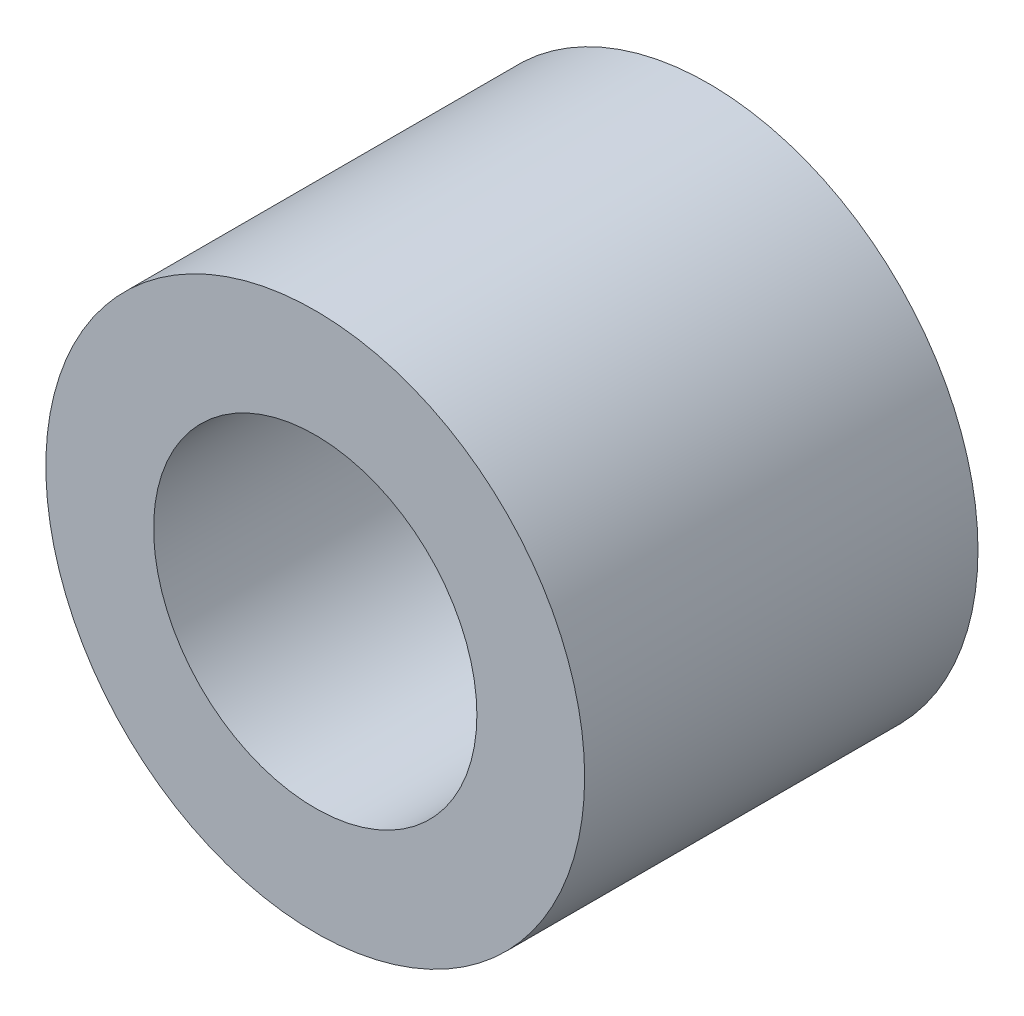
ISO-10303-21;
HEADER;
FILE_DESCRIPTION(('STEP AP214'),'2;1');
FILE_NAME('part.step','',(''),(''),'','','');
FILE_SCHEMA(('AUTOMOTIVE_DESIGN { 1 0 10303 214 1 1 1 1 }'));
ENDSEC;
DATA;
#1=APPLICATION_CONTEXT('core data for automotive mechanical design processes');
#2=APPLICATION_PROTOCOL_DEFINITION('international standard','automotive_design',2000,#1);
#3=PRODUCT_CONTEXT('',#1,'mechanical');
#4=PRODUCT('Part','Part','',(#3));
#5=PRODUCT_RELATED_PRODUCT_CATEGORY('part','',(#4));
#6=PRODUCT_DEFINITION_FORMATION('','',#4);
#7=PRODUCT_DEFINITION_CONTEXT('part definition',#1,'design');
#8=PRODUCT_DEFINITION('design','',#6,#7);
#9=PRODUCT_DEFINITION_SHAPE('','',#8);
#10=(LENGTH_UNIT() NAMED_UNIT(*) SI_UNIT(.MILLI.,.METRE.));
#11=(NAMED_UNIT(*) PLANE_ANGLE_UNIT() SI_UNIT($,.RADIAN.));
#12=(NAMED_UNIT(*) SI_UNIT($,.STERADIAN.) SOLID_ANGLE_UNIT());
#13=UNCERTAINTY_MEASURE_WITH_UNIT(LENGTH_MEASURE(1.E-05),#10,'distance_accuracy_value','');
#14=(GEOMETRIC_REPRESENTATION_CONTEXT(3) GLOBAL_UNCERTAINTY_ASSIGNED_CONTEXT((#13)) GLOBAL_UNIT_ASSIGNED_CONTEXT((#10,
#11,#12)) REPRESENTATION_CONTEXT('',''));
#15=CARTESIAN_POINT('',(0.,0.,0.));
#16=DIRECTION('',(0.,0.,1.));
#17=DIRECTION('',(1.,0.,0.));
#18=AXIS2_PLACEMENT_3D('',#15,#16,#17);
#19=CARTESIAN_POINT('',(0.,0.,3.65));
#20=DIRECTION('',(0.,0.,1.));
#21=DIRECTION('',(1.,0.,0.));
#22=AXIS2_PLACEMENT_3D('',#19,#20,#21);
#23=PLANE('',#22);
#24=CARTESIAN_POINT('',(0.,0.,3.65));
#25=DIRECTION('',(0.,0.,1.));
#26=DIRECTION('',(1.,0.,0.));
#27=AXIS2_PLACEMENT_3D('',#24,#25,#26);
#28=CIRCLE('',#27,2.5);
#29=CARTESIAN_POINT('',(2.5,0.,3.65));
#30=VERTEX_POINT('',#29);
#31=EDGE_CURVE('E10',#30,#30,#28,.T.);
#32=ORIENTED_EDGE('',*,*,#31,.T.);
#33=EDGE_LOOP('',(#32));
#34=FACE_BOUND('',#33,.T.);
#35=CARTESIAN_POINT('',(0.,0.,3.65));
#36=DIRECTION('',(0.,0.,1.));
#37=DIRECTION('',(1.,0.,0.));
#38=AXIS2_PLACEMENT_3D('',#35,#36,#37);
#39=CIRCLE('',#38,1.5);
#40=CARTESIAN_POINT('',(1.5,0.,3.65));
#41=VERTEX_POINT('',#40);
#42=EDGE_CURVE('E46',#41,#41,#39,.T.);
#43=ORIENTED_EDGE('',*,*,#42,.F.);
#44=EDGE_LOOP('',(#43));
#45=FACE_BOUND('',#44,.T.);
#46=ADVANCED_FACE('F35',(#34,#45),#23,.T.);
#47=CARTESIAN_POINT('',(0.,0.,0.));
#48=DIRECTION('',(0.,0.,1.));
#49=DIRECTION('',(1.,0.,0.));
#50=AXIS2_PLACEMENT_3D('',#47,#48,#49);
#51=PLANE('',#50);
#52=CARTESIAN_POINT('',(0.,0.,0.));
#53=DIRECTION('',(0.,0.,1.));
#54=DIRECTION('',(1.,0.,0.));
#55=AXIS2_PLACEMENT_3D('',#52,#53,#54);
#56=CIRCLE('',#55,2.5);
#57=CARTESIAN_POINT('',(2.5,0.,0.));
#58=VERTEX_POINT('',#57);
#59=EDGE_CURVE('E39',#58,#58,#56,.T.);
#60=ORIENTED_EDGE('',*,*,#59,.F.);
#61=EDGE_LOOP('',(#60));
#62=FACE_BOUND('',#61,.T.);
#63=CARTESIAN_POINT('',(0.,0.,0.));
#64=DIRECTION('',(0.,0.,1.));
#65=DIRECTION('',(1.,0.,0.));
#66=AXIS2_PLACEMENT_3D('',#63,#64,#65);
#67=CIRCLE('',#66,1.5);
#68=CARTESIAN_POINT('',(1.5,0.,0.));
#69=VERTEX_POINT('',#68);
#70=EDGE_CURVE('E48',#69,#69,#67,.T.);
#71=ORIENTED_EDGE('',*,*,#70,.T.);
#72=EDGE_LOOP('',(#71));
#73=FACE_BOUND('',#72,.T.);
#74=ADVANCED_FACE('F58',(#62,#73),#51,.F.);
#75=CARTESIAN_POINT('',(0.,0.,3.65));
#76=DIRECTION('',(0.,0.,-1.));
#77=DIRECTION('',(-1.,0.,0.));
#78=AXIS2_PLACEMENT_3D('',#75,#76,#77);
#79=CYLINDRICAL_SURFACE('',#78,2.5);
#80=ORIENTED_EDGE('',*,*,#31,.F.);
#81=EDGE_LOOP('',(#80));
#82=FACE_BOUND('',#81,.T.);
#83=ORIENTED_EDGE('',*,*,#59,.T.);
#84=EDGE_LOOP('',(#83));
#85=FACE_BOUND('',#84,.T.);
#86=ADVANCED_FACE('F37',(#82,#85),#79,.T.);
#87=CARTESIAN_POINT('',(0.,0.,3.65));
#88=DIRECTION('',(0.,0.,-1.));
#89=DIRECTION('',(-1.,0.,0.));
#90=AXIS2_PLACEMENT_3D('',#87,#88,#89);
#91=CYLINDRICAL_SURFACE('',#90,1.5);
#92=ORIENTED_EDGE('',*,*,#42,.T.);
#93=EDGE_LOOP('',(#92));
#94=FACE_BOUND('',#93,.T.);
#95=ORIENTED_EDGE('',*,*,#70,.F.);
#96=EDGE_LOOP('',(#95));
#97=FACE_BOUND('',#96,.T.);
#98=ADVANCED_FACE('F54',(#94,#97),#91,.F.);
#99=CLOSED_SHELL('',(#46,#74,#86,#98));
#100=MANIFOLD_SOLID_BREP('B2',#99);
#101=ADVANCED_BREP_SHAPE_REPRESENTATION('',(#18,#100),#14);
#102=SHAPE_DEFINITION_REPRESENTATION(#9,#101);
ENDSEC;
END-ISO-10303-21;
